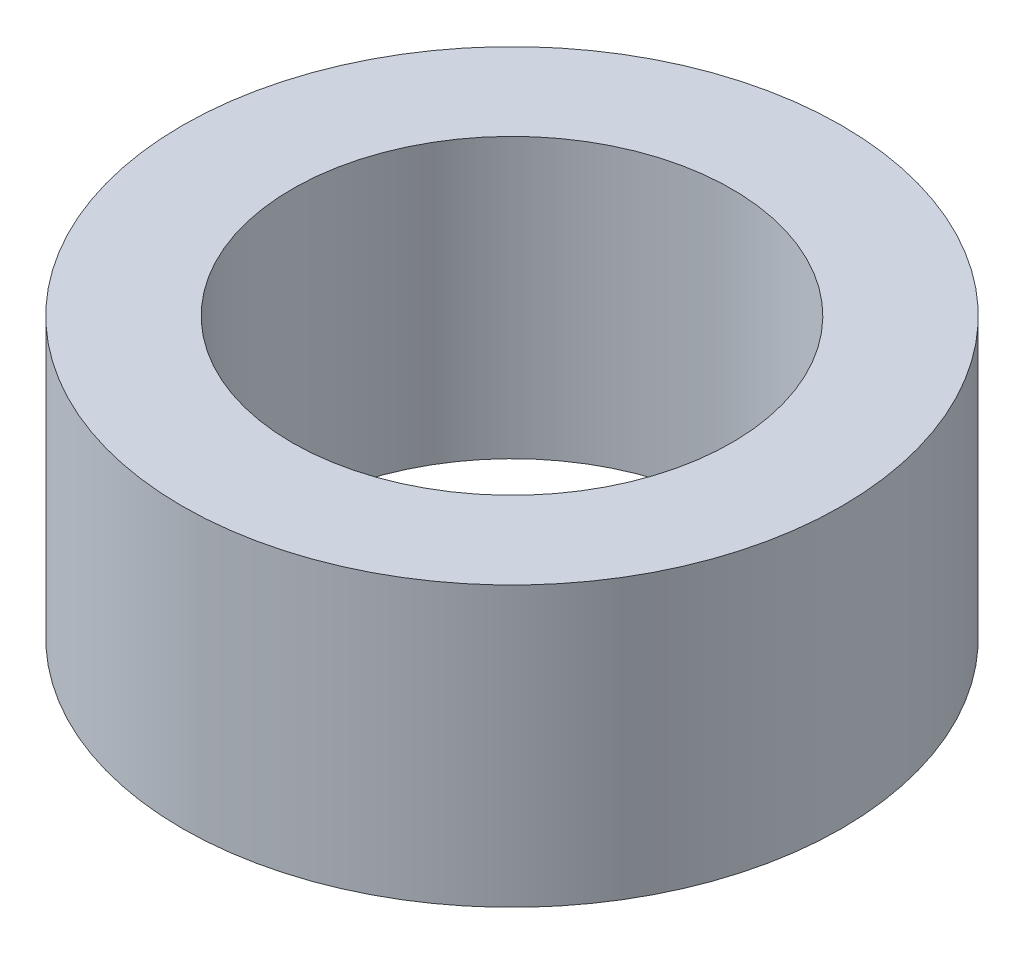
ISO-10303-21;
HEADER;
FILE_DESCRIPTION(('STEP AP214'),'2;1');
FILE_NAME('part.step','',(''),(''),'','','');
FILE_SCHEMA(('AUTOMOTIVE_DESIGN { 1 0 10303 214 1 1 1 1 }'));
ENDSEC;
DATA;
#1=APPLICATION_CONTEXT('core data for automotive mechanical design processes');
#2=APPLICATION_PROTOCOL_DEFINITION('international standard','automotive_design',2000,#1);
#3=PRODUCT_CONTEXT('',#1,'mechanical');
#4=PRODUCT('Part','Part','',(#3));
#5=PRODUCT_RELATED_PRODUCT_CATEGORY('part','',(#4));
#6=PRODUCT_DEFINITION_FORMATION('','',#4);
#7=PRODUCT_DEFINITION_CONTEXT('part definition',#1,'design');
#8=PRODUCT_DEFINITION('design','',#6,#7);
#9=PRODUCT_DEFINITION_SHAPE('','',#8);
#10=(LENGTH_UNIT() NAMED_UNIT(*) SI_UNIT(.MILLI.,.METRE.));
#11=(NAMED_UNIT(*) PLANE_ANGLE_UNIT() SI_UNIT($,.RADIAN.));
#12=(NAMED_UNIT(*) SI_UNIT($,.STERADIAN.) SOLID_ANGLE_UNIT());
#13=UNCERTAINTY_MEASURE_WITH_UNIT(LENGTH_MEASURE(1.E-05),#10,'distance_accuracy_value','');
#14=(GEOMETRIC_REPRESENTATION_CONTEXT(3) GLOBAL_UNCERTAINTY_ASSIGNED_CONTEXT((#13)) GLOBAL_UNIT_ASSIGNED_CONTEXT((#10,
#11,#12)) REPRESENTATION_CONTEXT('',''));
#15=CARTESIAN_POINT('',(0.,0.,0.));
#16=DIRECTION('',(0.,0.,1.));
#17=DIRECTION('',(1.,0.,0.));
#18=AXIS2_PLACEMENT_3D('',#15,#16,#17);
#19=CARTESIAN_POINT('',(0.,6.35,0.));
#20=DIRECTION('',(0.,1.,0.));
#21=DIRECTION('',(0.,0.,1.));
#22=AXIS2_PLACEMENT_3D('',#19,#20,#21);
#23=PLANE('',#22);
#24=CARTESIAN_POINT('',(0.,6.35,0.));
#25=DIRECTION('',(0.,1.,0.));
#26=DIRECTION('',(0.,0.,1.));
#27=AXIS2_PLACEMENT_3D('',#24,#25,#26);
#28=CIRCLE('',#27,7.5);
#29=CARTESIAN_POINT('',(0.,6.35,7.5));
#30=VERTEX_POINT('',#29);
#31=EDGE_CURVE('E10',#30,#30,#28,.T.);
#32=ORIENTED_EDGE('',*,*,#31,.T.);
#33=EDGE_LOOP('',(#32));
#34=FACE_BOUND('',#33,.T.);
#35=CARTESIAN_POINT('',(0.,6.35,0.));
#36=DIRECTION('',(0.,1.,0.));
#37=DIRECTION('',(0.,0.,1.));
#38=AXIS2_PLACEMENT_3D('',#35,#36,#37);
#39=CIRCLE('',#38,5.);
#40=CARTESIAN_POINT('',(0.,6.35,5.));
#41=VERTEX_POINT('',#40);
#42=EDGE_CURVE('E57',#41,#41,#39,.T.);
#43=ORIENTED_EDGE('',*,*,#42,.F.);
#44=EDGE_LOOP('',(#43));
#45=FACE_BOUND('',#44,.T.);
#46=ADVANCED_FACE('F42',(#34,#45),#23,.T.);
#47=CARTESIAN_POINT('',(0.,0.,0.));
#48=DIRECTION('',(0.,1.,0.));
#49=DIRECTION('',(0.,0.,1.));
#50=AXIS2_PLACEMENT_3D('',#47,#48,#49);
#51=PLANE('',#50);
#52=CARTESIAN_POINT('',(0.,0.,0.));
#53=DIRECTION('',(0.,1.,0.));
#54=DIRECTION('',(0.,0.,1.));
#55=AXIS2_PLACEMENT_3D('',#52,#53,#54);
#56=CIRCLE('',#55,7.5);
#57=CARTESIAN_POINT('',(0.,0.,7.5));
#58=VERTEX_POINT('',#57);
#59=EDGE_CURVE('E46',#58,#58,#56,.T.);
#60=ORIENTED_EDGE('',*,*,#59,.F.);
#61=EDGE_LOOP('',(#60));
#62=FACE_BOUND('',#61,.T.);
#63=CARTESIAN_POINT('',(0.,0.,0.));
#64=DIRECTION('',(0.,1.,0.));
#65=DIRECTION('',(0.,0.,1.));
#66=AXIS2_PLACEMENT_3D('',#63,#64,#65);
#67=CIRCLE('',#66,5.);
#68=CARTESIAN_POINT('',(0.,0.,5.));
#69=VERTEX_POINT('',#68);
#70=EDGE_CURVE('E59',#69,#69,#67,.T.);
#71=ORIENTED_EDGE('',*,*,#70,.T.);
#72=EDGE_LOOP('',(#71));
#73=FACE_BOUND('',#72,.T.);
#74=ADVANCED_FACE('F71',(#62,#73),#51,.F.);
#75=CARTESIAN_POINT('',(0.,6.35,0.));
#76=DIRECTION('',(0.,-1.,0.));
#77=DIRECTION('',(0.,0.,-1.));
#78=AXIS2_PLACEMENT_3D('',#75,#76,#77);
#79=CYLINDRICAL_SURFACE('',#78,7.5);
#80=ORIENTED_EDGE('',*,*,#31,.F.);
#81=EDGE_LOOP('',(#80));
#82=FACE_BOUND('',#81,.T.);
#83=ORIENTED_EDGE('',*,*,#59,.T.);
#84=EDGE_LOOP('',(#83));
#85=FACE_BOUND('',#84,.T.);
#86=ADVANCED_FACE('F44',(#82,#85),#79,.T.);
#87=CARTESIAN_POINT('',(0.,6.35,0.));
#88=DIRECTION('',(0.,-1.,0.));
#89=DIRECTION('',(0.,0.,-1.));
#90=AXIS2_PLACEMENT_3D('',#87,#88,#89);
#91=CYLINDRICAL_SURFACE('',#90,5.);
#92=ORIENTED_EDGE('',*,*,#42,.T.);
#93=EDGE_LOOP('',(#92));
#94=FACE_BOUND('',#93,.T.);
#95=ORIENTED_EDGE('',*,*,#70,.F.);
#96=EDGE_LOOP('',(#95));
#97=FACE_BOUND('',#96,.T.);
#98=ADVANCED_FACE('F67',(#94,#97),#91,.F.);
#99=CLOSED_SHELL('',(#46,#74,#86,#98));
#100=MANIFOLD_SOLID_BREP('B2',#99);
#101=ADVANCED_BREP_SHAPE_REPRESENTATION('',(#18,#100),#14);
#102=SHAPE_DEFINITION_REPRESENTATION(#9,#101);
ENDSEC;
END-ISO-10303-21;
